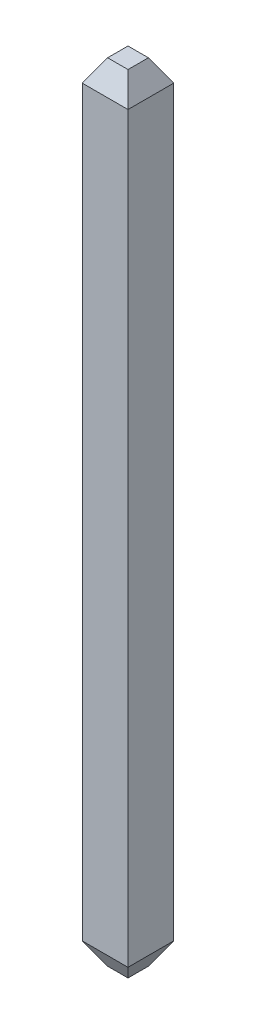
ISO-10303-21;
HEADER;
FILE_DESCRIPTION(('STEP AP214'),'2;1');
FILE_NAME('part.step','',(''),(''),'','','');
FILE_SCHEMA(('AUTOMOTIVE_DESIGN { 1 0 10303 214 1 1 1 1 }'));
ENDSEC;
DATA;
#1=APPLICATION_CONTEXT('core data for automotive mechanical design processes');
#2=APPLICATION_PROTOCOL_DEFINITION('international standard','automotive_design',2000,#1);
#3=PRODUCT_CONTEXT('',#1,'mechanical');
#4=PRODUCT('Part','Part','',(#3));
#5=PRODUCT_RELATED_PRODUCT_CATEGORY('part','',(#4));
#6=PRODUCT_DEFINITION_FORMATION('','',#4);
#7=PRODUCT_DEFINITION_CONTEXT('part definition',#1,'design');
#8=PRODUCT_DEFINITION('design','',#6,#7);
#9=PRODUCT_DEFINITION_SHAPE('','',#8);
#10=(LENGTH_UNIT() NAMED_UNIT(*) SI_UNIT(.MILLI.,.METRE.));
#11=(NAMED_UNIT(*) PLANE_ANGLE_UNIT() SI_UNIT($,.RADIAN.));
#12=(NAMED_UNIT(*) SI_UNIT($,.STERADIAN.) SOLID_ANGLE_UNIT());
#13=UNCERTAINTY_MEASURE_WITH_UNIT(LENGTH_MEASURE(1.E-05),#10,'distance_accuracy_value','');
#14=(GEOMETRIC_REPRESENTATION_CONTEXT(3) GLOBAL_UNCERTAINTY_ASSIGNED_CONTEXT((#13)) GLOBAL_UNIT_ASSIGNED_CONTEXT((#10,
#11,#12)) REPRESENTATION_CONTEXT('',''));
#15=CARTESIAN_POINT('',(0.,0.,0.));
#16=DIRECTION('',(0.,0.,1.));
#17=DIRECTION('',(1.,0.,0.));
#18=AXIS2_PLACEMENT_3D('',#15,#16,#17);
#19=CARTESIAN_POINT('',(-0.3175,-1.699383501272,-0.3175));
#20=DIRECTION('',(0.866025403784429,0.500000000000017,0.));
#21=DIRECTION('',(-0.500000000000017,0.866025403784429,0.));
#22=AXIS2_PLACEMENT_3D('',#19,#20,#21);
#23=PLANE('',#22);
#24=DIRECTION('',(0.,0.,-1.));
#25=VECTOR('',#24,1.);
#26=CARTESIAN_POINT('',(-0.141523637950999,-2.004183501272,-0.3175));
#27=LINE('',#26,#25);
#28=CARTESIAN_POINT('',(-0.141523637950997,-2.004183501272,0.141523637951));
#29=VERTEX_POINT('',#28);
#30=CARTESIAN_POINT('',(-0.141523637950997,-2.004183501272,-0.141523637950998));
#31=VERTEX_POINT('',#30);
#32=EDGE_CURVE('E79',#29,#31,#27,.T.);
#33=ORIENTED_EDGE('',*,*,#32,.F.);
#34=DIRECTION('',(0.447213595499964,-0.774596669241472,-0.447213595499972));
#35=VECTOR('',#34,1.);
#36=CARTESIAN_POINT('',(-0.3175,-1.699383501272,0.317500000000004));
#37=LINE('',#36,#35);
#38=CARTESIAN_POINT('',(-0.3175,-1.699383501272,0.317500000000002));
#39=VERTEX_POINT('',#38);
#40=EDGE_CURVE('E115',#39,#29,#37,.T.);
#41=ORIENTED_EDGE('',*,*,#40,.F.);
#42=DIRECTION('',(0.,0.,1.));
#43=VECTOR('',#42,1.);
#44=CARTESIAN_POINT('',(-0.3175,-1.699383501272,-0.3175));
#45=LINE('',#44,#43);
#46=CARTESIAN_POINT('',(-0.3175,-1.699383501272,-0.3175));
#47=VERTEX_POINT('',#46);
#48=EDGE_CURVE('E119',#47,#39,#45,.T.);
#49=ORIENTED_EDGE('',*,*,#48,.F.);
#50=DIRECTION('',(0.447213595499966,-0.774596669241471,0.447213595499971));
#51=VECTOR('',#50,1.);
#52=CARTESIAN_POINT('',(-0.3175,-1.699383501272,-0.3175));
#53=LINE('',#52,#51);
#54=EDGE_CURVE('E105',#47,#31,#53,.T.);
#55=ORIENTED_EDGE('',*,*,#54,.T.);
#56=EDGE_LOOP('',(#33,#41,#49,#55));
#57=FACE_BOUND('',#56,.T.);
#58=ADVANCED_FACE('F16',(#57),#23,.F.);
#59=CARTESIAN_POINT('',(-0.141523637951,8.91794,-0.3175));
#60=DIRECTION('',(-0.866025403784429,0.500000000000017,0.));
#61=DIRECTION('',(-0.500000000000017,-0.866025403784429,0.));
#62=AXIS2_PLACEMENT_3D('',#59,#60,#61);
#63=PLANE('',#62);
#64=DIRECTION('',(0.,0.,-1.));
#65=VECTOR('',#64,1.);
#66=CARTESIAN_POINT('',(-0.141523637950999,8.91794,-0.3175));
#67=LINE('',#66,#65);
#68=CARTESIAN_POINT('',(-0.141523637950999,8.91794,0.141523637950997));
#69=VERTEX_POINT('',#68);
#70=CARTESIAN_POINT('',(-0.141523637950999,8.91794,-0.141523637951));
#71=VERTEX_POINT('',#70);
#72=EDGE_CURVE('E19',#69,#71,#67,.T.);
#73=ORIENTED_EDGE('',*,*,#72,.T.);
#74=DIRECTION('',(0.44721359549997,0.77459666924147,0.44721359549997));
#75=VECTOR('',#74,1.);
#76=CARTESIAN_POINT('',(-0.317500000000002,8.61314,-0.317500000000003));
#77=LINE('',#76,#75);
#78=CARTESIAN_POINT('',(-0.317500000000002,8.61314,-0.317500000000001));
#79=VERTEX_POINT('',#78);
#80=EDGE_CURVE('E85',#79,#71,#77,.T.);
#81=ORIENTED_EDGE('',*,*,#80,.F.);
#82=DIRECTION('',(0.,0.,1.));
#83=VECTOR('',#82,1.);
#84=CARTESIAN_POINT('',(-0.3175,8.61314,-0.3175));
#85=LINE('',#84,#83);
#86=CARTESIAN_POINT('',(-0.317500000000002,8.61314,0.3175));
#87=VERTEX_POINT('',#86);
#88=EDGE_CURVE('E121',#87,#79,#85,.F.);
#89=ORIENTED_EDGE('',*,*,#88,.F.);
#90=DIRECTION('',(0.44721359549997,0.77459666924147,-0.44721359549997));
#91=VECTOR('',#90,1.);
#92=CARTESIAN_POINT('',(-0.317500000000002,8.61314,0.317499999999999));
#93=LINE('',#92,#91);
#94=EDGE_CURVE('E97',#87,#69,#93,.T.);
#95=ORIENTED_EDGE('',*,*,#94,.T.);
#96=EDGE_LOOP('',(#73,#81,#89,#95));
#97=FACE_BOUND('',#96,.T.);
#98=ADVANCED_FACE('F96',(#97),#63,.T.);
#99=CARTESIAN_POINT('',(16.29892163809,8.91794,-0.3175));
#100=DIRECTION('',(0.,-1.,0.));
#101=DIRECTION('',(0.,0.,-1.));
#102=AXIS2_PLACEMENT_3D('',#99,#100,#101);
#103=PLANE('',#102);
#104=DIRECTION('',(1.,0.,0.));
#105=VECTOR('',#104,1.);
#106=CARTESIAN_POINT('',(16.29892163809,8.91794,0.141523637950996));
#107=LINE('',#106,#105);
#108=CARTESIAN_POINT('',(0.141523637950998,8.91794,0.141523637950997));
#109=VERTEX_POINT('',#108);
#110=EDGE_CURVE('E113',#69,#109,#107,.T.);
#111=ORIENTED_EDGE('',*,*,#110,.T.);
#112=DIRECTION('',(0.,0.,1.));
#113=VECTOR('',#112,1.);
#114=CARTESIAN_POINT('',(0.141523637950996,8.91794,-0.3175));
#115=LINE('',#114,#113);
#116=CARTESIAN_POINT('',(0.141523637950998,8.91794,-0.141523637951));
#117=VERTEX_POINT('',#116);
#118=EDGE_CURVE('E103',#109,#117,#115,.F.);
#119=ORIENTED_EDGE('',*,*,#118,.T.);
#120=DIRECTION('',(1.,0.,0.));
#121=VECTOR('',#120,1.);
#122=CARTESIAN_POINT('',(16.29892163809,8.91794,-0.141523637951));
#123=LINE('',#122,#121);
#124=EDGE_CURVE('E90',#71,#117,#123,.T.);
#125=ORIENTED_EDGE('',*,*,#124,.F.);
#126=ORIENTED_EDGE('',*,*,#72,.F.);
#127=EDGE_LOOP('',(#111,#119,#125,#126));
#128=FACE_BOUND('',#127,.T.);
#129=ADVANCED_FACE('F102',(#128),#103,.F.);
#130=CARTESIAN_POINT('',(16.29892163809,8.91794,-0.141523637951));
#131=DIRECTION('',(0.,0.500000000000017,-0.866025403784429));
#132=DIRECTION('',(0.,0.866025403784429,0.500000000000017));
#133=AXIS2_PLACEMENT_3D('',#130,#131,#132);
#134=PLANE('',#133);
#135=ORIENTED_EDGE('',*,*,#124,.T.);
#136=DIRECTION('',(0.447213595499971,-0.774596669241471,-0.447213595499968));
#137=VECTOR('',#136,1.);
#138=CARTESIAN_POINT('',(0.141523637950996,8.91794,-0.141523637951));
#139=LINE('',#138,#137);
#140=CARTESIAN_POINT('',(0.317499999999999,8.61314,-0.317500000000003));
#141=VERTEX_POINT('',#140);
#142=EDGE_CURVE('E124',#117,#141,#139,.T.);
#143=ORIENTED_EDGE('',*,*,#142,.T.);
#144=DIRECTION('',(-1.,0.,0.));
#145=VECTOR('',#144,1.);
#146=CARTESIAN_POINT('',(16.29892163809,8.61314,-0.3175));
#147=LINE('',#146,#145);
#148=EDGE_CURVE('E92',#79,#141,#147,.F.);
#149=ORIENTED_EDGE('',*,*,#148,.F.);
#150=ORIENTED_EDGE('',*,*,#80,.T.);
#151=EDGE_LOOP('',(#135,#143,#149,#150));
#152=FACE_BOUND('',#151,.T.);
#153=ADVANCED_FACE('F87',(#152),#134,.T.);
#154=CARTESIAN_POINT('',(3.502643795812,-2.004183501272,-0.3175));
#155=DIRECTION('',(0.,-1.,0.));
#156=DIRECTION('',(0.,0.,-1.));
#157=AXIS2_PLACEMENT_3D('',#154,#155,#156);
#158=PLANE('',#157);
#159=DIRECTION('',(0.,0.,1.));
#160=VECTOR('',#159,1.);
#161=CARTESIAN_POINT('',(0.141523637951,-2.004183501272,-0.3175));
#162=LINE('',#161,#160);
#163=CARTESIAN_POINT('',(0.141523637951,-2.004183501272,0.141523637951));
#164=VERTEX_POINT('',#163);
#165=CARTESIAN_POINT('',(0.141523637951,-2.004183501272,-0.141523637950998));
#166=VERTEX_POINT('',#165);
#167=EDGE_CURVE('E136',#164,#166,#162,.F.);
#168=ORIENTED_EDGE('',*,*,#167,.F.);
#169=DIRECTION('',(1.,0.,0.));
#170=VECTOR('',#169,1.);
#171=CARTESIAN_POINT('',(3.502643795812,-2.004183501272,0.141523637951));
#172=LINE('',#171,#170);
#173=EDGE_CURVE('E117',#29,#164,#172,.T.);
#174=ORIENTED_EDGE('',*,*,#173,.F.);
#175=ORIENTED_EDGE('',*,*,#32,.T.);
#176=DIRECTION('',(1.,0.,0.));
#177=VECTOR('',#176,1.);
#178=CARTESIAN_POINT('',(3.502643795812,-2.004183501272,-0.141523637950996));
#179=LINE('',#178,#177);
#180=EDGE_CURVE('E110',#31,#166,#179,.T.);
#181=ORIENTED_EDGE('',*,*,#180,.T.);
#182=EDGE_LOOP('',(#168,#174,#175,#181));
#183=FACE_BOUND('',#182,.T.);
#184=ADVANCED_FACE('F205',(#183),#158,.T.);
#185=CARTESIAN_POINT('',(3.502643795812,-1.699383501272,-0.3175));
#186=DIRECTION('',(0.,0.500000000000017,0.866025403784429));
#187=DIRECTION('',(0.,-0.866025403784429,0.500000000000017));
#188=AXIS2_PLACEMENT_3D('',#185,#186,#187);
#189=PLANE('',#188);
#190=ORIENTED_EDGE('',*,*,#180,.F.);
#191=ORIENTED_EDGE('',*,*,#54,.F.);
#192=DIRECTION('',(-1.,0.,0.));
#193=VECTOR('',#192,1.);
#194=CARTESIAN_POINT('',(16.29892163809,-1.699383501272,-0.3175));
#195=LINE('',#194,#193);
#196=CARTESIAN_POINT('',(0.3175,-1.699383501272,-0.3175));
#197=VERTEX_POINT('',#196);
#198=EDGE_CURVE('E129',#197,#47,#195,.T.);
#199=ORIENTED_EDGE('',*,*,#198,.F.);
#200=DIRECTION('',(0.447213595499971,0.774596669241472,-0.447213595499964));
#201=VECTOR('',#200,1.);
#202=CARTESIAN_POINT('',(0.141523637951,-2.004183501272,-0.141523637950999));
#203=LINE('',#202,#201);
#204=EDGE_CURVE('E138',#166,#197,#203,.T.);
#205=ORIENTED_EDGE('',*,*,#204,.F.);
#206=EDGE_LOOP('',(#190,#191,#199,#205));
#207=FACE_BOUND('',#206,.T.);
#208=ADVANCED_FACE('F202',(#207),#189,.F.);
#209=CARTESIAN_POINT('',(16.29892163809,8.61314,0.3175));
#210=DIRECTION('',(0.,-0.500000000000017,-0.866025403784429));
#211=DIRECTION('',(0.,0.866025403784429,-0.500000000000017));
#212=AXIS2_PLACEMENT_3D('',#209,#210,#211);
#213=PLANE('',#212);
#214=ORIENTED_EDGE('',*,*,#110,.F.);
#215=ORIENTED_EDGE('',*,*,#94,.F.);
#216=DIRECTION('',(-1.,0.,0.));
#217=VECTOR('',#216,1.);
#218=CARTESIAN_POINT('',(16.29892163809,8.61314,0.3175));
#219=LINE('',#218,#217);
#220=CARTESIAN_POINT('',(0.3175,8.61314,0.3175));
#221=VERTEX_POINT('',#220);
#222=EDGE_CURVE('E143',#87,#221,#219,.F.);
#223=ORIENTED_EDGE('',*,*,#222,.T.);
#224=DIRECTION('',(-0.447213595499971,0.774596669241471,-0.447213595499966));
#225=VECTOR('',#224,1.);
#226=CARTESIAN_POINT('',(0.3175,8.61314,0.3175));
#227=LINE('',#226,#225);
#228=EDGE_CURVE('E126',#221,#109,#227,.T.);
#229=ORIENTED_EDGE('',*,*,#228,.T.);
#230=EDGE_LOOP('',(#214,#215,#223,#229));
#231=FACE_BOUND('',#230,.T.);
#232=ADVANCED_FACE('F176',(#231),#213,.F.);
#233=CARTESIAN_POINT('',(3.502643795812,-2.004183501272,0.141523637951));
#234=DIRECTION('',(0.,-0.500000000000017,0.866025403784429));
#235=DIRECTION('',(0.,-0.866025403784429,-0.500000000000017));
#236=AXIS2_PLACEMENT_3D('',#233,#234,#235);
#237=PLANE('',#236);
#238=ORIENTED_EDGE('',*,*,#173,.T.);
#239=DIRECTION('',(-0.447213595499971,-0.774596669241471,-0.447213595499967));
#240=VECTOR('',#239,1.);
#241=CARTESIAN_POINT('',(0.317500000000004,-1.699383501272,0.317500000000002));
#242=LINE('',#241,#240);
#243=CARTESIAN_POINT('',(0.317500000000002,-1.699383501272,0.317500000000003));
#244=VERTEX_POINT('',#243);
#245=EDGE_CURVE('E140',#244,#164,#242,.T.);
#246=ORIENTED_EDGE('',*,*,#245,.F.);
#247=DIRECTION('',(-1.,0.,0.));
#248=VECTOR('',#247,1.);
#249=CARTESIAN_POINT('',(16.29892163809,-1.699383501272,0.3175));
#250=LINE('',#249,#248);
#251=EDGE_CURVE('E33',#244,#39,#250,.T.);
#252=ORIENTED_EDGE('',*,*,#251,.T.);
#253=ORIENTED_EDGE('',*,*,#40,.T.);
#254=EDGE_LOOP('',(#238,#246,#252,#253));
#255=FACE_BOUND('',#254,.T.);
#256=ADVANCED_FACE('F195',(#255),#237,.T.);
#257=CARTESIAN_POINT('',(-0.3175,8.91794,-0.3175));
#258=DIRECTION('',(-1.,0.,0.));
#259=DIRECTION('',(0.,0.,1.));
#260=AXIS2_PLACEMENT_3D('',#257,#258,#259);
#261=PLANE('',#260);
#262=ORIENTED_EDGE('',*,*,#88,.T.);
#263=DIRECTION('',(0.,1.,0.));
#264=VECTOR('',#263,1.);
#265=CARTESIAN_POINT('',(-0.317499999999998,8.91794,-0.3175));
#266=LINE('',#265,#264);
#267=EDGE_CURVE('E132',#47,#79,#266,.T.);
#268=ORIENTED_EDGE('',*,*,#267,.F.);
#269=ORIENTED_EDGE('',*,*,#48,.T.);
#270=DIRECTION('',(0.,1.,0.));
#271=VECTOR('',#270,1.);
#272=CARTESIAN_POINT('',(-0.317499999999998,8.91794,0.3175));
#273=LINE('',#272,#271);
#274=EDGE_CURVE('E147',#39,#87,#273,.T.);
#275=ORIENTED_EDGE('',*,*,#274,.T.);
#276=EDGE_LOOP('',(#262,#268,#269,#275));
#277=FACE_BOUND('',#276,.T.);
#278=ADVANCED_FACE('F192',(#277),#261,.T.);
#279=CARTESIAN_POINT('',(0.3175,8.61314,-0.3175));
#280=DIRECTION('',(-0.866025403784429,-0.500000000000017,0.));
#281=DIRECTION('',(0.500000000000017,-0.866025403784429,0.));
#282=AXIS2_PLACEMENT_3D('',#279,#280,#281);
#283=PLANE('',#282);
#284=DIRECTION('',(0.,0.,1.));
#285=VECTOR('',#284,1.);
#286=CARTESIAN_POINT('',(0.3175,8.61314,-0.3175));
#287=LINE('',#286,#285);
#288=EDGE_CURVE('E150',#221,#141,#287,.F.);
#289=ORIENTED_EDGE('',*,*,#288,.T.);
#290=ORIENTED_EDGE('',*,*,#142,.F.);
#291=ORIENTED_EDGE('',*,*,#118,.F.);
#292=ORIENTED_EDGE('',*,*,#228,.F.);
#293=EDGE_LOOP('',(#289,#290,#291,#292));
#294=FACE_BOUND('',#293,.T.);
#295=ADVANCED_FACE('F173',(#294),#283,.F.);
#296=CARTESIAN_POINT('',(16.29892163809,8.91794,-0.3175));
#297=DIRECTION('',(0.,0.,-1.));
#298=DIRECTION('',(-1.,0.,0.));
#299=AXIS2_PLACEMENT_3D('',#296,#297,#298);
#300=PLANE('',#299);
#301=ORIENTED_EDGE('',*,*,#148,.T.);
#302=DIRECTION('',(0.,1.,0.));
#303=VECTOR('',#302,1.);
#304=CARTESIAN_POINT('',(0.3175,8.91794,-0.317500000000002));
#305=LINE('',#304,#303);
#306=EDGE_CURVE('E153',#141,#197,#305,.F.);
#307=ORIENTED_EDGE('',*,*,#306,.T.);
#308=ORIENTED_EDGE('',*,*,#198,.T.);
#309=ORIENTED_EDGE('',*,*,#267,.T.);
#310=EDGE_LOOP('',(#301,#307,#308,#309));
#311=FACE_BOUND('',#310,.T.);
#312=ADVANCED_FACE('F169',(#311),#300,.T.);
#313=CARTESIAN_POINT('',(0.141523637951,-2.004183501272,-0.3175));
#314=DIRECTION('',(0.866025403784429,-0.500000000000017,0.));
#315=DIRECTION('',(0.500000000000017,0.866025403784429,0.));
#316=AXIS2_PLACEMENT_3D('',#313,#314,#315);
#317=PLANE('',#316);
#318=DIRECTION('',(0.,0.,1.));
#319=VECTOR('',#318,1.);
#320=CARTESIAN_POINT('',(0.3175,-1.699383501272,-0.3175));
#321=LINE('',#320,#319);
#322=EDGE_CURVE('E25',#197,#244,#321,.T.);
#323=ORIENTED_EDGE('',*,*,#322,.T.);
#324=ORIENTED_EDGE('',*,*,#245,.T.);
#325=ORIENTED_EDGE('',*,*,#167,.T.);
#326=ORIENTED_EDGE('',*,*,#204,.T.);
#327=EDGE_LOOP('',(#323,#324,#325,#326));
#328=FACE_BOUND('',#327,.T.);
#329=ADVANCED_FACE('F159',(#328),#317,.T.);
#330=CARTESIAN_POINT('',(16.29892163809,8.91794,0.3175));
#331=DIRECTION('',(0.,0.,-1.));
#332=DIRECTION('',(-1.,0.,0.));
#333=AXIS2_PLACEMENT_3D('',#330,#331,#332);
#334=PLANE('',#333);
#335=ORIENTED_EDGE('',*,*,#251,.F.);
#336=DIRECTION('',(0.,1.,0.));
#337=VECTOR('',#336,1.);
#338=CARTESIAN_POINT('',(0.3175,8.91794,0.317500000000002));
#339=LINE('',#338,#337);
#340=EDGE_CURVE('E11',#244,#221,#339,.T.);
#341=ORIENTED_EDGE('',*,*,#340,.T.);
#342=ORIENTED_EDGE('',*,*,#222,.F.);
#343=ORIENTED_EDGE('',*,*,#274,.F.);
#344=EDGE_LOOP('',(#335,#341,#342,#343));
#345=FACE_BOUND('',#344,.T.);
#346=ADVANCED_FACE('F177',(#345),#334,.F.);
#347=CARTESIAN_POINT('',(0.3175,8.91794,-0.3175));
#348=DIRECTION('',(-1.,0.,0.));
#349=DIRECTION('',(0.,0.,1.));
#350=AXIS2_PLACEMENT_3D('',#347,#348,#349);
#351=PLANE('',#350);
#352=ORIENTED_EDGE('',*,*,#322,.F.);
#353=ORIENTED_EDGE('',*,*,#306,.F.);
#354=ORIENTED_EDGE('',*,*,#288,.F.);
#355=ORIENTED_EDGE('',*,*,#340,.F.);
#356=EDGE_LOOP('',(#352,#353,#354,#355));
#357=FACE_BOUND('',#356,.T.);
#358=ADVANCED_FACE('F166',(#357),#351,.F.);
#359=CLOSED_SHELL('',(#58,#98,#129,#153,#184,#208,#232,#256,#278,#295,#312,#329,#346,#358));
#360=MANIFOLD_SOLID_BREP('B1',#359);
#361=ADVANCED_BREP_SHAPE_REPRESENTATION('',(#18,#360),#14);
#362=SHAPE_DEFINITION_REPRESENTATION(#9,#361);
ENDSEC;
END-ISO-10303-21;
